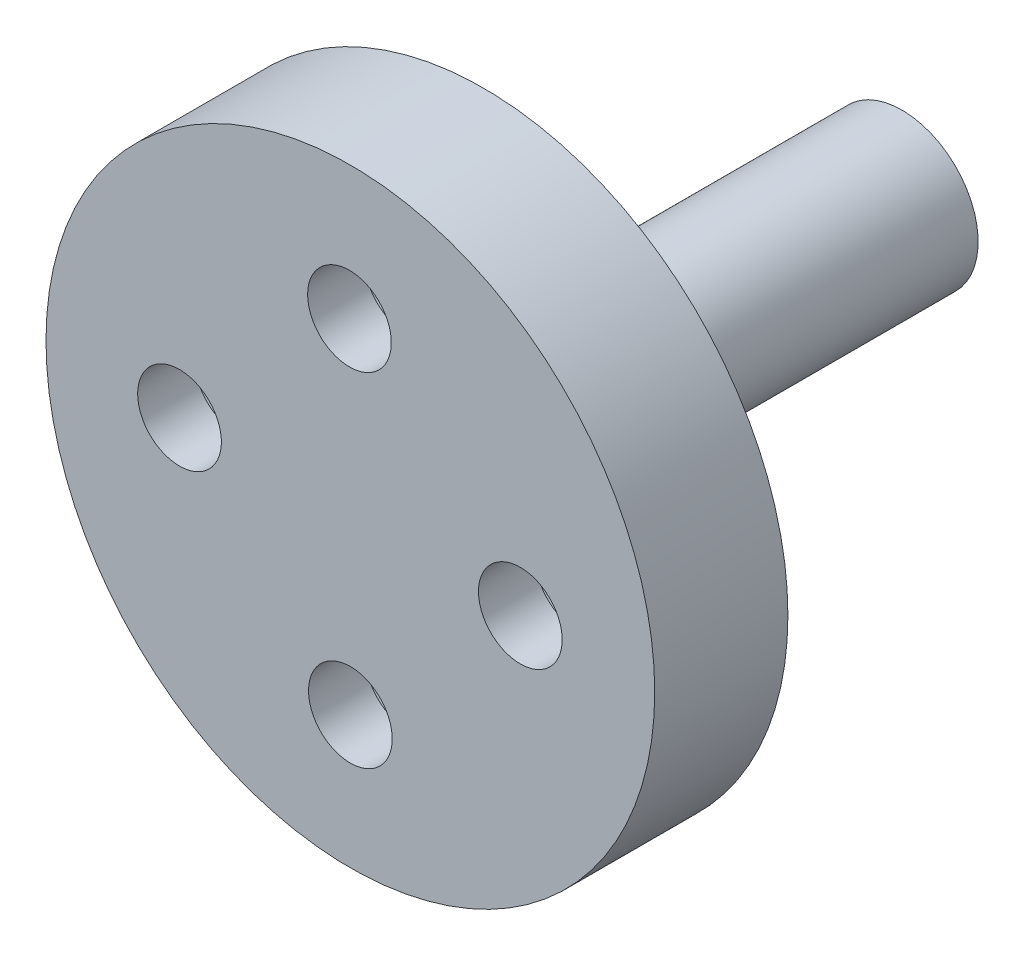
ISO-10303-21;
HEADER;
FILE_DESCRIPTION(('STEP AP214'),'2;1');
FILE_NAME('part.step','',(''),(''),'','','');
FILE_SCHEMA(('AUTOMOTIVE_DESIGN { 1 0 10303 214 1 1 1 1 }'));
ENDSEC;
DATA;
#1=APPLICATION_CONTEXT('core data for automotive mechanical design processes');
#2=APPLICATION_PROTOCOL_DEFINITION('international standard','automotive_design',2000,#1);
#3=PRODUCT_CONTEXT('',#1,'mechanical');
#4=PRODUCT('Part','Part','',(#3));
#5=PRODUCT_RELATED_PRODUCT_CATEGORY('part','',(#4));
#6=PRODUCT_DEFINITION_FORMATION('','',#4);
#7=PRODUCT_DEFINITION_CONTEXT('part definition',#1,'design');
#8=PRODUCT_DEFINITION('design','',#6,#7);
#9=PRODUCT_DEFINITION_SHAPE('','',#8);
#10=(LENGTH_UNIT() NAMED_UNIT(*) SI_UNIT(.MILLI.,.METRE.));
#11=(NAMED_UNIT(*) PLANE_ANGLE_UNIT() SI_UNIT($,.RADIAN.));
#12=(NAMED_UNIT(*) SI_UNIT($,.STERADIAN.) SOLID_ANGLE_UNIT());
#13=UNCERTAINTY_MEASURE_WITH_UNIT(LENGTH_MEASURE(1.E-05),#10,'distance_accuracy_value','');
#14=(GEOMETRIC_REPRESENTATION_CONTEXT(3) GLOBAL_UNCERTAINTY_ASSIGNED_CONTEXT((#13)) GLOBAL_UNIT_ASSIGNED_CONTEXT((#10,
#11,#12)) REPRESENTATION_CONTEXT('',''));
#15=CARTESIAN_POINT('',(0.,0.,0.));
#16=DIRECTION('',(0.,0.,1.));
#17=DIRECTION('',(1.,0.,0.));
#18=AXIS2_PLACEMENT_3D('',#15,#16,#17);
#19=CARTESIAN_POINT('',(0.,0.,0.));
#20=DIRECTION('',(0.,0.,-1.));
#21=DIRECTION('',(-1.,0.,0.));
#22=AXIS2_PLACEMENT_3D('',#19,#20,#21);
#23=PLANE('',#22);
#24=CARTESIAN_POINT('',(-4.49122807017544,0.,0.));
#25=DIRECTION('',(0.,0.,-1.));
#26=DIRECTION('',(-1.,0.,0.));
#27=AXIS2_PLACEMENT_3D('',#24,#25,#26);
#28=CIRCLE('',#27,1.1);
#29=CARTESIAN_POINT('',(-5.59122807017544,0.,0.));
#30=VERTEX_POINT('',#29);
#31=EDGE_CURVE('E108',#30,#30,#28,.T.);
#32=ORIENTED_EDGE('',*,*,#31,.T.);
#33=EDGE_LOOP('',(#32));
#34=FACE_BOUND('',#33,.T.);
#35=CARTESIAN_POINT('',(-0.0238895110115689,4.49122807017541,0.));
#36=DIRECTION('',(0.,0.,-1.));
#37=DIRECTION('',(-1.,0.,0.));
#38=AXIS2_PLACEMENT_3D('',#35,#36,#37);
#39=CIRCLE('',#38,1.1);
#40=CARTESIAN_POINT('',(-1.12388951101157,4.49122807017541,0.));
#41=VERTEX_POINT('',#40);
#42=EDGE_CURVE('E92',#41,#41,#39,.T.);
#43=ORIENTED_EDGE('',*,*,#42,.T.);
#44=EDGE_LOOP('',(#43));
#45=FACE_BOUND('',#44,.T.);
#46=CARTESIAN_POINT('',(4.46733855916387,-0.0238895110115987,0.));
#47=DIRECTION('',(0.,0.,-1.));
#48=DIRECTION('',(-1.,0.,0.));
#49=AXIS2_PLACEMENT_3D('',#46,#47,#48);
#50=CIRCLE('',#49,1.1);
#51=CARTESIAN_POINT('',(3.36733855916387,-0.0238895110115987,0.));
#52=VERTEX_POINT('',#51);
#53=EDGE_CURVE('E76',#52,#52,#50,.T.);
#54=ORIENTED_EDGE('',*,*,#53,.T.);
#55=EDGE_LOOP('',(#54));
#56=FACE_BOUND('',#55,.T.);
#57=CARTESIAN_POINT('',(0.,-4.51511758118704,0.));
#58=DIRECTION('',(0.,0.,-1.));
#59=DIRECTION('',(-1.,0.,0.));
#60=AXIS2_PLACEMENT_3D('',#57,#58,#59);
#61=CIRCLE('',#60,1.1);
#62=CARTESIAN_POINT('',(-1.1,-4.51511758118704,0.));
#63=VERTEX_POINT('',#62);
#64=EDGE_CURVE('E60',#63,#63,#61,.T.);
#65=ORIENTED_EDGE('',*,*,#64,.T.);
#66=EDGE_LOOP('',(#65));
#67=FACE_BOUND('',#66,.T.);
#68=CARTESIAN_POINT('',(0.,0.,0.));
#69=DIRECTION('',(0.,0.,-1.));
#70=DIRECTION('',(-1.,0.,0.));
#71=AXIS2_PLACEMENT_3D('',#68,#69,#70);
#72=CIRCLE('',#71,8.);
#73=CARTESIAN_POINT('',(-8.,0.,0.));
#74=VERTEX_POINT('',#73);
#75=EDGE_CURVE('E10',#74,#74,#72,.T.);
#76=ORIENTED_EDGE('',*,*,#75,.F.);
#77=EDGE_LOOP('',(#76));
#78=FACE_BOUND('',#77,.T.);
#79=ADVANCED_FACE('F37',(#34,#45,#56,#67,#78),#23,.F.);
#80=CARTESIAN_POINT('',(0.,0.,-14.5));
#81=DIRECTION('',(0.,0.,-1.));
#82=DIRECTION('',(-1.,0.,0.));
#83=AXIS2_PLACEMENT_3D('',#80,#81,#82);
#84=CYLINDRICAL_SURFACE('',#83,8.);
#85=CARTESIAN_POINT('',(0.,0.,-3.5));
#86=DIRECTION('',(0.,0.,-1.));
#87=DIRECTION('',(-1.,0.,0.));
#88=AXIS2_PLACEMENT_3D('',#85,#86,#87);
#89=CIRCLE('',#88,8.);
#90=CARTESIAN_POINT('',(-8.,0.,-3.5));
#91=VERTEX_POINT('',#90);
#92=EDGE_CURVE('E44',#91,#91,#89,.T.);
#93=ORIENTED_EDGE('',*,*,#92,.F.);
#94=EDGE_LOOP('',(#93));
#95=FACE_BOUND('',#94,.T.);
#96=ORIENTED_EDGE('',*,*,#75,.T.);
#97=EDGE_LOOP('',(#96));
#98=FACE_BOUND('',#97,.T.);
#99=ADVANCED_FACE('F131',(#95,#98),#84,.T.);
#100=CARTESIAN_POINT('',(8.,0.,-3.5));
#101=DIRECTION('',(0.,0.,1.));
#102=DIRECTION('',(1.,0.,0.));
#103=AXIS2_PLACEMENT_3D('',#100,#101,#102);
#104=PLANE('',#103);
#105=CARTESIAN_POINT('',(-4.49122807017544,0.,-3.5));
#106=DIRECTION('',(0.,0.,-1.));
#107=DIRECTION('',(-1.,0.,0.));
#108=AXIS2_PLACEMENT_3D('',#105,#106,#107);
#109=CIRCLE('',#108,2.19999999999999);
#110=CARTESIAN_POINT('',(-6.69122807017543,0.,-3.5));
#111=VERTEX_POINT('',#110);
#112=EDGE_CURVE('E120',#111,#111,#109,.T.);
#113=ORIENTED_EDGE('',*,*,#112,.F.);
#114=EDGE_LOOP('',(#113));
#115=FACE_BOUND('',#114,.T.);
#116=CARTESIAN_POINT('',(-0.0238895110115689,4.49122807017541,-3.5));
#117=DIRECTION('',(0.,0.,-1.));
#118=DIRECTION('',(-1.,0.,0.));
#119=AXIS2_PLACEMENT_3D('',#116,#117,#118);
#120=CIRCLE('',#119,2.19999999999999);
#121=CARTESIAN_POINT('',(-2.22388951101156,4.49122807017541,-3.5));
#122=VERTEX_POINT('',#121);
#123=EDGE_CURVE('E104',#122,#122,#120,.T.);
#124=ORIENTED_EDGE('',*,*,#123,.F.);
#125=EDGE_LOOP('',(#124));
#126=FACE_BOUND('',#125,.T.);
#127=CARTESIAN_POINT('',(4.46733855916387,-0.0238895110115987,-3.5));
#128=DIRECTION('',(0.,0.,-1.));
#129=DIRECTION('',(-1.,0.,0.));
#130=AXIS2_PLACEMENT_3D('',#127,#128,#129);
#131=CIRCLE('',#130,2.19999999999999);
#132=CARTESIAN_POINT('',(2.26733855916388,-0.0238895110115987,-3.5));
#133=VERTEX_POINT('',#132);
#134=EDGE_CURVE('E88',#133,#133,#131,.T.);
#135=ORIENTED_EDGE('',*,*,#134,.F.);
#136=EDGE_LOOP('',(#135));
#137=FACE_BOUND('',#136,.T.);
#138=CARTESIAN_POINT('',(0.,-4.51511758118704,-3.5));
#139=DIRECTION('',(0.,0.,-1.));
#140=DIRECTION('',(-1.,0.,0.));
#141=AXIS2_PLACEMENT_3D('',#138,#139,#140);
#142=CIRCLE('',#141,2.19999999999999);
#143=CARTESIAN_POINT('',(-2.19999999999999,-4.51511758118704,-3.5));
#144=VERTEX_POINT('',#143);
#145=EDGE_CURVE('E72',#144,#144,#142,.T.);
#146=ORIENTED_EDGE('',*,*,#145,.F.);
#147=EDGE_LOOP('',(#146));
#148=FACE_BOUND('',#147,.T.);
#149=CARTESIAN_POINT('',(0.,0.,-3.5));
#150=DIRECTION('',(0.,0.,-1.));
#151=DIRECTION('',(-1.,0.,0.));
#152=AXIS2_PLACEMENT_3D('',#149,#150,#151);
#153=CIRCLE('',#152,2.);
#154=CARTESIAN_POINT('',(-2.,0.,-3.5));
#155=VERTEX_POINT('',#154);
#156=EDGE_CURVE('E49',#155,#155,#153,.T.);
#157=ORIENTED_EDGE('',*,*,#156,.F.);
#158=EDGE_LOOP('',(#157));
#159=FACE_BOUND('',#158,.T.);
#160=ORIENTED_EDGE('',*,*,#92,.T.);
#161=EDGE_LOOP('',(#160));
#162=FACE_BOUND('',#161,.T.);
#163=ADVANCED_FACE('F127',(#115,#126,#137,#148,#159,#162),#104,.F.);
#164=CARTESIAN_POINT('',(0.,0.,-14.5));
#165=DIRECTION('',(0.,0.,-1.));
#166=DIRECTION('',(-1.,0.,0.));
#167=AXIS2_PLACEMENT_3D('',#164,#165,#166);
#168=CYLINDRICAL_SURFACE('',#167,2.);
#169=CARTESIAN_POINT('',(0.,0.,-14.5));
#170=DIRECTION('',(0.,0.,-1.));
#171=DIRECTION('',(-1.,0.,0.));
#172=AXIS2_PLACEMENT_3D('',#169,#170,#171);
#173=CIRCLE('',#172,2.);
#174=CARTESIAN_POINT('',(-2.,0.,-14.5));
#175=VERTEX_POINT('',#174);
#176=EDGE_CURVE('E54',#175,#175,#173,.T.);
#177=ORIENTED_EDGE('',*,*,#176,.F.);
#178=EDGE_LOOP('',(#177));
#179=FACE_BOUND('',#178,.T.);
#180=ORIENTED_EDGE('',*,*,#156,.T.);
#181=EDGE_LOOP('',(#180));
#182=FACE_BOUND('',#181,.T.);
#183=ADVANCED_FACE('F130',(#179,#182),#168,.T.);
#184=CARTESIAN_POINT('',(2.,0.,-14.5));
#185=DIRECTION('',(0.,0.,1.));
#186=DIRECTION('',(1.,0.,0.));
#187=AXIS2_PLACEMENT_3D('',#184,#185,#186);
#188=PLANE('',#187);
#189=ORIENTED_EDGE('',*,*,#176,.T.);
#190=EDGE_LOOP('',(#189));
#191=FACE_BOUND('',#190,.T.);
#192=ADVANCED_FACE('F142',(#191),#188,.F.);
#193=CARTESIAN_POINT('',(0.,-4.51511758118704,-3.5));
#194=DIRECTION('',(0.,0.,-1.));
#195=DIRECTION('',(-1.,0.,0.));
#196=AXIS2_PLACEMENT_3D('',#193,#194,#195);
#197=CYLINDRICAL_SURFACE('',#196,1.1);
#198=ORIENTED_EDGE('',*,*,#64,.F.);
#199=EDGE_LOOP('',(#198));
#200=FACE_BOUND('',#199,.T.);
#201=CARTESIAN_POINT('',(0.,-4.51511758118704,-1.5));
#202=DIRECTION('',(0.,0.,-1.));
#203=DIRECTION('',(-1.,0.,0.));
#204=AXIS2_PLACEMENT_3D('',#201,#202,#203);
#205=CIRCLE('',#204,1.1);
#206=CARTESIAN_POINT('',(-1.1,-4.51511758118704,-1.5));
#207=VERTEX_POINT('',#206);
#208=EDGE_CURVE('E64',#207,#207,#205,.T.);
#209=ORIENTED_EDGE('',*,*,#208,.T.);
#210=EDGE_LOOP('',(#209));
#211=FACE_BOUND('',#210,.T.);
#212=ADVANCED_FACE('F148',(#200,#211),#197,.F.);
#213=CARTESIAN_POINT('',(1.1,-4.51511758118704,-1.5));
#214=DIRECTION('',(0.,0.,1.));
#215=DIRECTION('',(1.,0.,0.));
#216=AXIS2_PLACEMENT_3D('',#213,#214,#215);
#217=PLANE('',#216);
#218=ORIENTED_EDGE('',*,*,#208,.F.);
#219=EDGE_LOOP('',(#218));
#220=FACE_BOUND('',#219,.T.);
#221=CARTESIAN_POINT('',(0.,-4.51511758118704,-1.5));
#222=DIRECTION('',(0.,0.,-1.));
#223=DIRECTION('',(-1.,0.,0.));
#224=AXIS2_PLACEMENT_3D('',#221,#222,#223);
#225=CIRCLE('',#224,2.2);
#226=CARTESIAN_POINT('',(-2.2,-4.51511758118704,-1.5));
#227=VERTEX_POINT('',#226);
#228=EDGE_CURVE('E68',#227,#227,#225,.T.);
#229=ORIENTED_EDGE('',*,*,#228,.T.);
#230=EDGE_LOOP('',(#229));
#231=FACE_BOUND('',#230,.T.);
#232=ADVANCED_FACE('F169',(#220,#231),#217,.F.);
#233=CARTESIAN_POINT('',(0.,-4.51511758118704,-3.5));
#234=DIRECTION('',(0.,0.,-1.));
#235=DIRECTION('',(-1.,0.,0.));
#236=AXIS2_PLACEMENT_3D('',#233,#234,#235);
#237=CYLINDRICAL_SURFACE('',#236,2.19999999999999);
#238=ORIENTED_EDGE('',*,*,#228,.F.);
#239=EDGE_LOOP('',(#238));
#240=FACE_BOUND('',#239,.T.);
#241=ORIENTED_EDGE('',*,*,#145,.T.);
#242=EDGE_LOOP('',(#241));
#243=FACE_BOUND('',#242,.T.);
#244=ADVANCED_FACE('F175',(#240,#243),#237,.F.);
#245=CARTESIAN_POINT('',(4.46733855916387,-0.0238895110115987,-3.5));
#246=DIRECTION('',(0.,0.,-1.));
#247=DIRECTION('',(-1.,0.,0.));
#248=AXIS2_PLACEMENT_3D('',#245,#246,#247);
#249=CYLINDRICAL_SURFACE('',#248,1.1);
#250=ORIENTED_EDGE('',*,*,#53,.F.);
#251=EDGE_LOOP('',(#250));
#252=FACE_BOUND('',#251,.T.);
#253=CARTESIAN_POINT('',(4.46733855916387,-0.0238895110115987,-1.5));
#254=DIRECTION('',(0.,0.,-1.));
#255=DIRECTION('',(-1.,0.,0.));
#256=AXIS2_PLACEMENT_3D('',#253,#254,#255);
#257=CIRCLE('',#256,1.1);
#258=CARTESIAN_POINT('',(3.36733855916387,-0.0238895110115987,-1.5));
#259=VERTEX_POINT('',#258);
#260=EDGE_CURVE('E80',#259,#259,#257,.T.);
#261=ORIENTED_EDGE('',*,*,#260,.T.);
#262=EDGE_LOOP('',(#261));
#263=FACE_BOUND('',#262,.T.);
#264=ADVANCED_FACE('F181',(#252,#263),#249,.F.);
#265=CARTESIAN_POINT('',(5.56733855916387,-0.0238895110115987,-1.5));
#266=DIRECTION('',(0.,0.,1.));
#267=DIRECTION('',(1.,0.,0.));
#268=AXIS2_PLACEMENT_3D('',#265,#266,#267);
#269=PLANE('',#268);
#270=ORIENTED_EDGE('',*,*,#260,.F.);
#271=EDGE_LOOP('',(#270));
#272=FACE_BOUND('',#271,.T.);
#273=CARTESIAN_POINT('',(4.46733855916387,-0.0238895110115987,-1.5));
#274=DIRECTION('',(0.,0.,-1.));
#275=DIRECTION('',(-1.,0.,0.));
#276=AXIS2_PLACEMENT_3D('',#273,#274,#275);
#277=CIRCLE('',#276,2.2);
#278=CARTESIAN_POINT('',(2.26733855916387,-0.0238895110115987,-1.5));
#279=VERTEX_POINT('',#278);
#280=EDGE_CURVE('E84',#279,#279,#277,.T.);
#281=ORIENTED_EDGE('',*,*,#280,.T.);
#282=EDGE_LOOP('',(#281));
#283=FACE_BOUND('',#282,.T.);
#284=ADVANCED_FACE('F186',(#272,#283),#269,.F.);
#285=CARTESIAN_POINT('',(4.46733855916387,-0.0238895110115987,-3.5));
#286=DIRECTION('',(0.,0.,-1.));
#287=DIRECTION('',(-1.,0.,0.));
#288=AXIS2_PLACEMENT_3D('',#285,#286,#287);
#289=CYLINDRICAL_SURFACE('',#288,2.19999999999999);
#290=ORIENTED_EDGE('',*,*,#280,.F.);
#291=EDGE_LOOP('',(#290));
#292=FACE_BOUND('',#291,.T.);
#293=ORIENTED_EDGE('',*,*,#134,.T.);
#294=EDGE_LOOP('',(#293));
#295=FACE_BOUND('',#294,.T.);
#296=ADVANCED_FACE('F192',(#292,#295),#289,.F.);
#297=CARTESIAN_POINT('',(-0.0238895110115689,4.49122807017541,-3.5));
#298=DIRECTION('',(0.,0.,-1.));
#299=DIRECTION('',(-1.,0.,0.));
#300=AXIS2_PLACEMENT_3D('',#297,#298,#299);
#301=CYLINDRICAL_SURFACE('',#300,1.1);
#302=ORIENTED_EDGE('',*,*,#42,.F.);
#303=EDGE_LOOP('',(#302));
#304=FACE_BOUND('',#303,.T.);
#305=CARTESIAN_POINT('',(-0.0238895110115689,4.49122807017541,-1.5));
#306=DIRECTION('',(0.,0.,-1.));
#307=DIRECTION('',(-1.,0.,0.));
#308=AXIS2_PLACEMENT_3D('',#305,#306,#307);
#309=CIRCLE('',#308,1.1);
#310=CARTESIAN_POINT('',(-1.12388951101157,4.49122807017541,-1.5));
#311=VERTEX_POINT('',#310);
#312=EDGE_CURVE('E96',#311,#311,#309,.T.);
#313=ORIENTED_EDGE('',*,*,#312,.T.);
#314=EDGE_LOOP('',(#313));
#315=FACE_BOUND('',#314,.T.);
#316=ADVANCED_FACE('F196',(#304,#315),#301,.F.);
#317=CARTESIAN_POINT('',(1.07611048898843,4.49122807017541,-1.5));
#318=DIRECTION('',(0.,0.,1.));
#319=DIRECTION('',(1.,0.,0.));
#320=AXIS2_PLACEMENT_3D('',#317,#318,#319);
#321=PLANE('',#320);
#322=ORIENTED_EDGE('',*,*,#312,.F.);
#323=EDGE_LOOP('',(#322));
#324=FACE_BOUND('',#323,.T.);
#325=CARTESIAN_POINT('',(-0.0238895110115689,4.49122807017541,-1.5));
#326=DIRECTION('',(0.,0.,-1.));
#327=DIRECTION('',(-1.,0.,0.));
#328=AXIS2_PLACEMENT_3D('',#325,#326,#327);
#329=CIRCLE('',#328,2.2);
#330=CARTESIAN_POINT('',(-2.22388951101157,4.49122807017541,-1.5));
#331=VERTEX_POINT('',#330);
#332=EDGE_CURVE('E100',#331,#331,#329,.T.);
#333=ORIENTED_EDGE('',*,*,#332,.T.);
#334=EDGE_LOOP('',(#333));
#335=FACE_BOUND('',#334,.T.);
#336=ADVANCED_FACE('F200',(#324,#335),#321,.F.);
#337=CARTESIAN_POINT('',(-0.0238895110115689,4.49122807017541,-3.5));
#338=DIRECTION('',(0.,0.,-1.));
#339=DIRECTION('',(-1.,0.,0.));
#340=AXIS2_PLACEMENT_3D('',#337,#338,#339);
#341=CYLINDRICAL_SURFACE('',#340,2.19999999999999);
#342=ORIENTED_EDGE('',*,*,#332,.F.);
#343=EDGE_LOOP('',(#342));
#344=FACE_BOUND('',#343,.T.);
#345=ORIENTED_EDGE('',*,*,#123,.T.);
#346=EDGE_LOOP('',(#345));
#347=FACE_BOUND('',#346,.T.);
#348=ADVANCED_FACE('F204',(#344,#347),#341,.F.);
#349=CARTESIAN_POINT('',(-4.49122807017544,0.,-3.5));
#350=DIRECTION('',(0.,0.,-1.));
#351=DIRECTION('',(-1.,0.,0.));
#352=AXIS2_PLACEMENT_3D('',#349,#350,#351);
#353=CYLINDRICAL_SURFACE('',#352,1.1);
#354=ORIENTED_EDGE('',*,*,#31,.F.);
#355=EDGE_LOOP('',(#354));
#356=FACE_BOUND('',#355,.T.);
#357=CARTESIAN_POINT('',(-4.49122807017544,0.,-1.5));
#358=DIRECTION('',(0.,0.,-1.));
#359=DIRECTION('',(-1.,0.,0.));
#360=AXIS2_PLACEMENT_3D('',#357,#358,#359);
#361=CIRCLE('',#360,1.1);
#362=CARTESIAN_POINT('',(-5.59122807017544,0.,-1.5));
#363=VERTEX_POINT('',#362);
#364=EDGE_CURVE('E112',#363,#363,#361,.T.);
#365=ORIENTED_EDGE('',*,*,#364,.T.);
#366=EDGE_LOOP('',(#365));
#367=FACE_BOUND('',#366,.T.);
#368=ADVANCED_FACE('F208',(#356,#367),#353,.F.);
#369=CARTESIAN_POINT('',(-3.39122807017544,0.,-1.5));
#370=DIRECTION('',(0.,0.,1.));
#371=DIRECTION('',(1.,0.,0.));
#372=AXIS2_PLACEMENT_3D('',#369,#370,#371);
#373=PLANE('',#372);
#374=ORIENTED_EDGE('',*,*,#364,.F.);
#375=EDGE_LOOP('',(#374));
#376=FACE_BOUND('',#375,.T.);
#377=CARTESIAN_POINT('',(-4.49122807017544,0.,-1.5));
#378=DIRECTION('',(0.,0.,-1.));
#379=DIRECTION('',(-1.,0.,0.));
#380=AXIS2_PLACEMENT_3D('',#377,#378,#379);
#381=CIRCLE('',#380,2.2);
#382=CARTESIAN_POINT('',(-6.69122807017543,0.,-1.5));
#383=VERTEX_POINT('',#382);
#384=EDGE_CURVE('E116',#383,#383,#381,.T.);
#385=ORIENTED_EDGE('',*,*,#384,.T.);
#386=EDGE_LOOP('',(#385));
#387=FACE_BOUND('',#386,.T.);
#388=ADVANCED_FACE('F212',(#376,#387),#373,.F.);
#389=CARTESIAN_POINT('',(-4.49122807017544,0.,-3.5));
#390=DIRECTION('',(0.,0.,-1.));
#391=DIRECTION('',(-1.,0.,0.));
#392=AXIS2_PLACEMENT_3D('',#389,#390,#391);
#393=CYLINDRICAL_SURFACE('',#392,2.19999999999999);
#394=ORIENTED_EDGE('',*,*,#384,.F.);
#395=EDGE_LOOP('',(#394));
#396=FACE_BOUND('',#395,.T.);
#397=ORIENTED_EDGE('',*,*,#112,.T.);
#398=EDGE_LOOP('',(#397));
#399=FACE_BOUND('',#398,.T.);
#400=ADVANCED_FACE('F125',(#396,#399),#393,.F.);
#401=CLOSED_SHELL('',(#79,#99,#163,#183,#192,#212,#232,#244,#264,#284,#296,#316,#336,#348,#368,
#388,#400));
#402=MANIFOLD_SOLID_BREP('B2',#401);
#403=ADVANCED_BREP_SHAPE_REPRESENTATION('',(#18,#402),#14);
#404=SHAPE_DEFINITION_REPRESENTATION(#9,#403);
ENDSEC;
END-ISO-10303-21;
